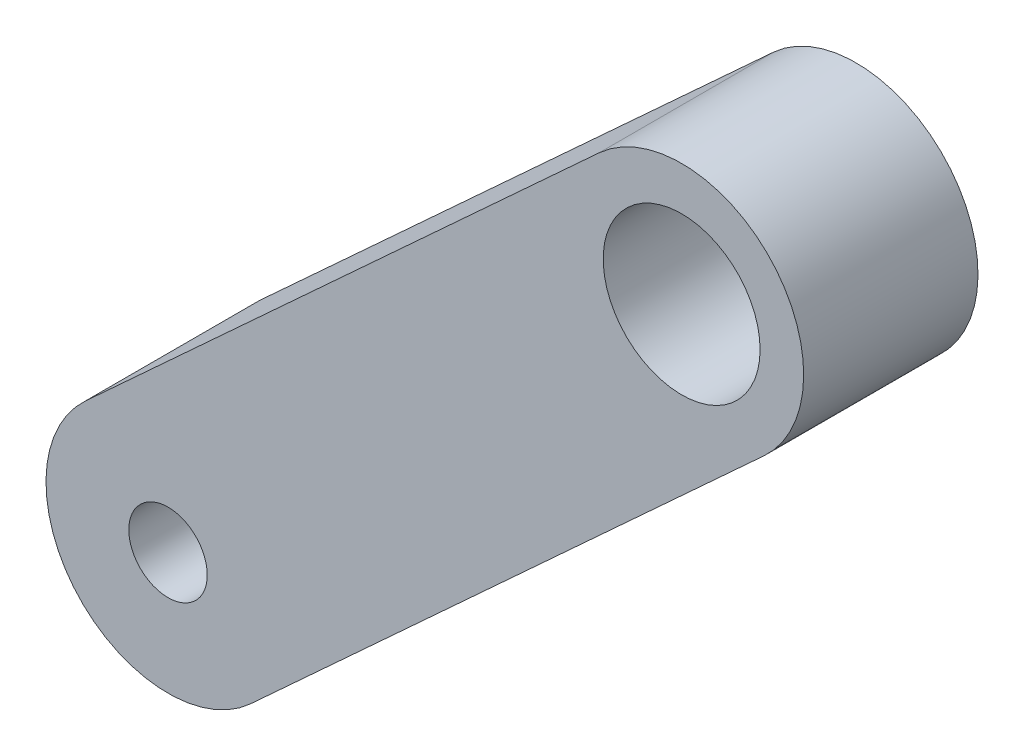
ISO-10303-21;
HEADER;
FILE_DESCRIPTION(('STEP AP214'),'2;1');
FILE_NAME('part.step','',(''),(''),'','','');
FILE_SCHEMA(('AUTOMOTIVE_DESIGN { 1 0 10303 214 1 1 1 1 }'));
ENDSEC;
DATA;
#1=APPLICATION_CONTEXT('core data for automotive mechanical design processes');
#2=APPLICATION_PROTOCOL_DEFINITION('international standard','automotive_design',2000,#1);
#3=PRODUCT_CONTEXT('',#1,'mechanical');
#4=PRODUCT('Part','Part','',(#3));
#5=PRODUCT_RELATED_PRODUCT_CATEGORY('part','',(#4));
#6=PRODUCT_DEFINITION_FORMATION('','',#4);
#7=PRODUCT_DEFINITION_CONTEXT('part definition',#1,'design');
#8=PRODUCT_DEFINITION('design','',#6,#7);
#9=PRODUCT_DEFINITION_SHAPE('','',#8);
#10=(LENGTH_UNIT() NAMED_UNIT(*) SI_UNIT(.MILLI.,.METRE.));
#11=(NAMED_UNIT(*) PLANE_ANGLE_UNIT() SI_UNIT($,.RADIAN.));
#12=(NAMED_UNIT(*) SI_UNIT($,.STERADIAN.) SOLID_ANGLE_UNIT());
#13=UNCERTAINTY_MEASURE_WITH_UNIT(LENGTH_MEASURE(1.E-05),#10,'distance_accuracy_value','');
#14=(GEOMETRIC_REPRESENTATION_CONTEXT(3) GLOBAL_UNCERTAINTY_ASSIGNED_CONTEXT((#13)) GLOBAL_UNIT_ASSIGNED_CONTEXT((#10,
#11,#12)) REPRESENTATION_CONTEXT('',''));
#15=CARTESIAN_POINT('',(0.,0.,0.));
#16=DIRECTION('',(0.,0.,1.));
#17=DIRECTION('',(1.,0.,0.));
#18=AXIS2_PLACEMENT_3D('',#15,#16,#17);
#19=CARTESIAN_POINT('',(0.,0.,100.));
#20=DIRECTION('',(0.,0.,1.));
#21=DIRECTION('',(1.,0.,0.));
#22=AXIS2_PLACEMENT_3D('',#19,#20,#21);
#23=PLANE('',#22);
#24=CARTESIAN_POINT('',(0.,0.,100.));
#25=DIRECTION('',(0.,0.,1.));
#26=DIRECTION('',(1.,0.,0.));
#27=AXIS2_PLACEMENT_3D('',#24,#25,#26);
#28=CIRCLE('',#27,22.5);
#29=CARTESIAN_POINT('',(22.5,0.,100.));
#30=VERTEX_POINT('',#29);
#31=EDGE_CURVE('E116',#30,#30,#28,.T.);
#32=ORIENTED_EDGE('',*,*,#31,.F.);
#33=EDGE_LOOP('',(#32));
#34=FACE_BOUND('',#33,.T.);
#35=CARTESIAN_POINT('',(0.,0.,100.));
#36=DIRECTION('',(0.,0.,1.));
#37=DIRECTION('',(1.,0.,0.));
#38=AXIS2_PLACEMENT_3D('',#35,#36,#37);
#39=CIRCLE('',#38,70.);
#40=CARTESIAN_POINT('',(-47.3470648552437,51.5582723681985,100.));
#41=VERTEX_POINT('',#40);
#42=CARTESIAN_POINT('',(47.3470648552437,-51.5582723681985,100.));
#43=VERTEX_POINT('',#42);
#44=EDGE_CURVE('E96',#41,#43,#39,.T.);
#45=ORIENTED_EDGE('',*,*,#44,.T.);
#46=DIRECTION('',(0.73654674811712,0.676386640789198,0.));
#47=VECTOR('',#46,1.);
#48=CARTESIAN_POINT('',(47.3470648552437,-51.5582723681985,100.));
#49=LINE('',#48,#47);
#50=CARTESIAN_POINT('',(341.965764102092,218.99638394748,100.));
#51=VERTEX_POINT('',#50);
#52=EDGE_CURVE('E91',#43,#51,#49,.T.);
#53=ORIENTED_EDGE('',*,*,#52,.T.);
#54=CARTESIAN_POINT('',(294.618699246849,270.554656315679,100.));
#55=DIRECTION('',(0.,0.,1.));
#56=DIRECTION('',(1.,0.,0.));
#57=AXIS2_PLACEMENT_3D('',#54,#55,#56);
#58=CIRCLE('',#57,69.9999999999997);
#59=CARTESIAN_POINT('',(247.271634391605,322.112928683877,100.));
#60=VERTEX_POINT('',#59);
#61=EDGE_CURVE('E94',#51,#60,#58,.T.);
#62=ORIENTED_EDGE('',*,*,#61,.T.);
#63=DIRECTION('',(-0.736546748117122,-0.676386640789197,0.));
#64=VECTOR('',#63,1.);
#65=CARTESIAN_POINT('',(-47.3470648552437,51.5582723681985,100.));
#66=LINE('',#65,#64);
#67=EDGE_CURVE('E61',#60,#41,#66,.T.);
#68=ORIENTED_EDGE('',*,*,#67,.T.);
#69=EDGE_LOOP('',(#45,#53,#62,#68));
#70=FACE_BOUND('',#69,.T.);
#71=CARTESIAN_POINT('',(294.618699246849,270.554656315679,100.));
#72=DIRECTION('',(0.,0.,1.));
#73=DIRECTION('',(1.,0.,0.));
#74=AXIS2_PLACEMENT_3D('',#71,#72,#73);
#75=CIRCLE('',#74,44.9999999999998);
#76=CARTESIAN_POINT('',(339.618699246849,270.554656315679,100.));
#77=VERTEX_POINT('',#76);
#78=EDGE_CURVE('E138',#77,#77,#75,.T.);
#79=ORIENTED_EDGE('',*,*,#78,.F.);
#80=EDGE_LOOP('',(#79));
#81=FACE_BOUND('',#80,.T.);
#82=ADVANCED_FACE('F43',(#34,#70,#81),#23,.T.);
#83=CARTESIAN_POINT('',(0.,0.,0.));
#84=DIRECTION('',(0.,0.,1.));
#85=DIRECTION('',(1.,0.,0.));
#86=AXIS2_PLACEMENT_3D('',#83,#84,#85);
#87=PLANE('',#86);
#88=CARTESIAN_POINT('',(0.,0.,0.));
#89=DIRECTION('',(0.,0.,1.));
#90=DIRECTION('',(1.,0.,0.));
#91=AXIS2_PLACEMENT_3D('',#88,#89,#90);
#92=CIRCLE('',#91,70.);
#93=CARTESIAN_POINT('',(-47.3470648552437,51.5582723681985,0.));
#94=VERTEX_POINT('',#93);
#95=CARTESIAN_POINT('',(47.3470648552437,-51.5582723681985,0.));
#96=VERTEX_POINT('',#95);
#97=EDGE_CURVE('E112',#94,#96,#92,.T.);
#98=ORIENTED_EDGE('',*,*,#97,.F.);
#99=DIRECTION('',(-0.736546748117122,-0.676386640789197,0.));
#100=VECTOR('',#99,1.);
#101=CARTESIAN_POINT('',(-47.3470648552437,51.5582723681985,0.));
#102=LINE('',#101,#100);
#103=CARTESIAN_POINT('',(247.271634391605,322.112928683877,0.));
#104=VERTEX_POINT('',#103);
#105=EDGE_CURVE('E84',#104,#94,#102,.T.);
#106=ORIENTED_EDGE('',*,*,#105,.F.);
#107=CARTESIAN_POINT('',(294.618699246849,270.554656315679,0.));
#108=DIRECTION('',(0.,0.,1.));
#109=DIRECTION('',(1.,0.,0.));
#110=AXIS2_PLACEMENT_3D('',#107,#108,#109);
#111=CIRCLE('',#110,69.9999999999997);
#112=CARTESIAN_POINT('',(341.965764102092,218.99638394748,0.));
#113=VERTEX_POINT('',#112);
#114=EDGE_CURVE('E78',#113,#104,#111,.T.);
#115=ORIENTED_EDGE('',*,*,#114,.F.);
#116=DIRECTION('',(0.73654674811712,0.676386640789198,0.));
#117=VECTOR('',#116,1.);
#118=CARTESIAN_POINT('',(47.3470648552437,-51.5582723681985,0.));
#119=LINE('',#118,#117);
#120=EDGE_CURVE('E101',#96,#113,#119,.T.);
#121=ORIENTED_EDGE('',*,*,#120,.F.);
#122=EDGE_LOOP('',(#98,#106,#115,#121));
#123=FACE_BOUND('',#122,.T.);
#124=CARTESIAN_POINT('',(0.,0.,0.));
#125=DIRECTION('',(0.,0.,1.));
#126=DIRECTION('',(1.,0.,0.));
#127=AXIS2_PLACEMENT_3D('',#124,#125,#126);
#128=CIRCLE('',#127,22.5);
#129=CARTESIAN_POINT('',(22.5,0.,0.));
#130=VERTEX_POINT('',#129);
#131=EDGE_CURVE('E134',#130,#130,#128,.T.);
#132=ORIENTED_EDGE('',*,*,#131,.T.);
#133=EDGE_LOOP('',(#132));
#134=FACE_BOUND('',#133,.T.);
#135=CARTESIAN_POINT('',(294.618699246849,270.554656315679,0.));
#136=DIRECTION('',(0.,0.,1.));
#137=DIRECTION('',(1.,0.,0.));
#138=AXIS2_PLACEMENT_3D('',#135,#136,#137);
#139=CIRCLE('',#138,44.9999999999998);
#140=CARTESIAN_POINT('',(339.618699246849,270.554656315679,0.));
#141=VERTEX_POINT('',#140);
#142=EDGE_CURVE('E142',#141,#141,#139,.T.);
#143=ORIENTED_EDGE('',*,*,#142,.T.);
#144=EDGE_LOOP('',(#143));
#145=FACE_BOUND('',#144,.T.);
#146=ADVANCED_FACE('F129',(#123,#134,#145),#87,.F.);
#147=CARTESIAN_POINT('',(0.,0.,100.));
#148=DIRECTION('',(0.,0.,-1.));
#149=DIRECTION('',(-1.,0.,0.));
#150=AXIS2_PLACEMENT_3D('',#147,#148,#149);
#151=CYLINDRICAL_SURFACE('',#150,70.);
#152=ORIENTED_EDGE('',*,*,#97,.T.);
#153=DIRECTION('',(0.,0.,-1.));
#154=VECTOR('',#153,1.);
#155=CARTESIAN_POINT('',(47.3470648552437,-51.5582723681985,100.));
#156=LINE('',#155,#154);
#157=EDGE_CURVE('E11',#43,#96,#156,.T.);
#158=ORIENTED_EDGE('',*,*,#157,.F.);
#159=ORIENTED_EDGE('',*,*,#44,.F.);
#160=DIRECTION('',(0.,0.,-1.));
#161=VECTOR('',#160,1.);
#162=CARTESIAN_POINT('',(-47.3470648552437,51.5582723681985,100.));
#163=LINE('',#162,#161);
#164=EDGE_CURVE('E108',#41,#94,#163,.T.);
#165=ORIENTED_EDGE('',*,*,#164,.T.);
#166=EDGE_LOOP('',(#152,#158,#159,#165));
#167=FACE_BOUND('',#166,.T.);
#168=ADVANCED_FACE('F45',(#167),#151,.T.);
#169=CARTESIAN_POINT('',(47.3470648552437,-51.5582723681985,100.));
#170=DIRECTION('',(-0.676386640789198,0.73654674811712,0.));
#171=DIRECTION('',(-0.73654674811712,-0.676386640789198,0.));
#172=AXIS2_PLACEMENT_3D('',#169,#170,#171);
#173=PLANE('',#172);
#174=ORIENTED_EDGE('',*,*,#120,.T.);
#175=DIRECTION('',(0.,0.,-1.));
#176=VECTOR('',#175,1.);
#177=CARTESIAN_POINT('',(341.965764102092,218.99638394748,100.));
#178=LINE('',#177,#176);
#179=EDGE_CURVE('E53',#51,#113,#178,.T.);
#180=ORIENTED_EDGE('',*,*,#179,.F.);
#181=ORIENTED_EDGE('',*,*,#52,.F.);
#182=ORIENTED_EDGE('',*,*,#157,.T.);
#183=EDGE_LOOP('',(#174,#180,#181,#182));
#184=FACE_BOUND('',#183,.T.);
#185=ADVANCED_FACE('F100',(#184),#173,.F.);
#186=CARTESIAN_POINT('',(294.618699246849,270.554656315679,100.));
#187=DIRECTION('',(0.,0.,-1.));
#188=DIRECTION('',(-1.,0.,0.));
#189=AXIS2_PLACEMENT_3D('',#186,#187,#188);
#190=CYLINDRICAL_SURFACE('',#189,69.9999999999997);
#191=ORIENTED_EDGE('',*,*,#114,.T.);
#192=DIRECTION('',(0.,0.,-1.));
#193=VECTOR('',#192,1.);
#194=CARTESIAN_POINT('',(247.271634391605,322.112928683877,100.));
#195=LINE('',#194,#193);
#196=EDGE_CURVE('E103',#60,#104,#195,.T.);
#197=ORIENTED_EDGE('',*,*,#196,.F.);
#198=ORIENTED_EDGE('',*,*,#61,.F.);
#199=ORIENTED_EDGE('',*,*,#179,.T.);
#200=EDGE_LOOP('',(#191,#197,#198,#199));
#201=FACE_BOUND('',#200,.T.);
#202=ADVANCED_FACE('F104',(#201),#190,.T.);
#203=CARTESIAN_POINT('',(-47.3470648552437,51.5582723681985,100.));
#204=DIRECTION('',(0.676386640789197,-0.736546748117121,0.));
#205=DIRECTION('',(0.736546748117121,0.676386640789197,0.));
#206=AXIS2_PLACEMENT_3D('',#203,#204,#205);
#207=PLANE('',#206);
#208=ORIENTED_EDGE('',*,*,#105,.T.);
#209=ORIENTED_EDGE('',*,*,#164,.F.);
#210=ORIENTED_EDGE('',*,*,#67,.F.);
#211=ORIENTED_EDGE('',*,*,#196,.T.);
#212=EDGE_LOOP('',(#208,#209,#210,#211));
#213=FACE_BOUND('',#212,.T.);
#214=ADVANCED_FACE('F126',(#213),#207,.F.);
#215=CARTESIAN_POINT('',(0.,0.,100.));
#216=DIRECTION('',(0.,0.,-1.));
#217=DIRECTION('',(-1.,0.,0.));
#218=AXIS2_PLACEMENT_3D('',#215,#216,#217);
#219=CYLINDRICAL_SURFACE('',#218,22.5);
#220=ORIENTED_EDGE('',*,*,#31,.T.);
#221=EDGE_LOOP('',(#220));
#222=FACE_BOUND('',#221,.T.);
#223=ORIENTED_EDGE('',*,*,#131,.F.);
#224=EDGE_LOOP('',(#223));
#225=FACE_BOUND('',#224,.T.);
#226=ADVANCED_FACE('F161',(#222,#225),#219,.F.);
#227=CARTESIAN_POINT('',(294.618699246849,270.554656315679,100.));
#228=DIRECTION('',(0.,0.,-1.));
#229=DIRECTION('',(-1.,0.,0.));
#230=AXIS2_PLACEMENT_3D('',#227,#228,#229);
#231=CYLINDRICAL_SURFACE('',#230,44.9999999999998);
#232=ORIENTED_EDGE('',*,*,#78,.T.);
#233=EDGE_LOOP('',(#232));
#234=FACE_BOUND('',#233,.T.);
#235=ORIENTED_EDGE('',*,*,#142,.F.);
#236=EDGE_LOOP('',(#235));
#237=FACE_BOUND('',#236,.T.);
#238=ADVANCED_FACE('F150',(#234,#237),#231,.F.);
#239=CLOSED_SHELL('',(#82,#146,#168,#185,#202,#214,#226,#238));
#240=MANIFOLD_SOLID_BREP('B2',#239);
#241=ADVANCED_BREP_SHAPE_REPRESENTATION('',(#18,#240),#14);
#242=SHAPE_DEFINITION_REPRESENTATION(#9,#241);
ENDSEC;
END-ISO-10303-21;
